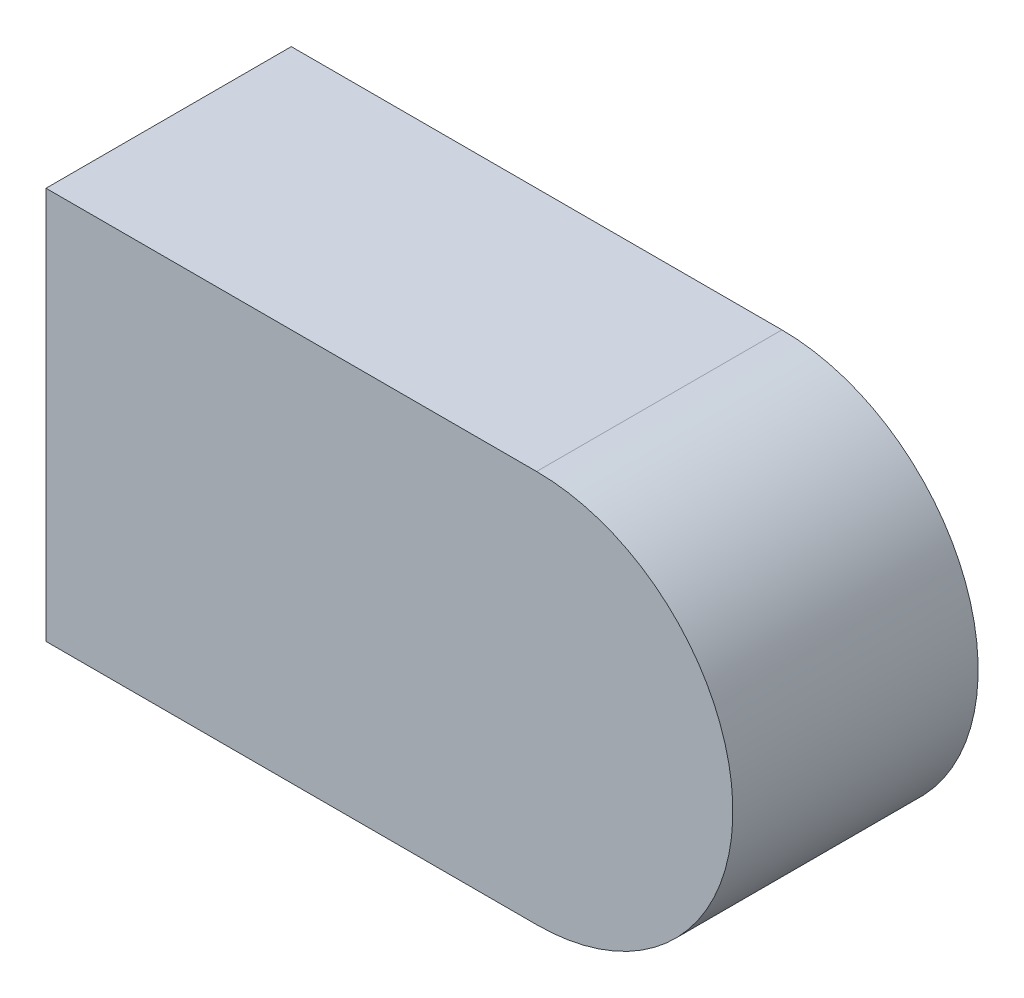
ISO-10303-21;
HEADER;
FILE_DESCRIPTION(('STEP AP214'),'2;1');
FILE_NAME('part.step','',(''),(''),'','','');
FILE_SCHEMA(('AUTOMOTIVE_DESIGN { 1 0 10303 214 1 1 1 1 }'));
ENDSEC;
DATA;
#1=APPLICATION_CONTEXT('core data for automotive mechanical design processes');
#2=APPLICATION_PROTOCOL_DEFINITION('international standard','automotive_design',2000,#1);
#3=PRODUCT_CONTEXT('',#1,'mechanical');
#4=PRODUCT('Part','Part','',(#3));
#5=PRODUCT_RELATED_PRODUCT_CATEGORY('part','',(#4));
#6=PRODUCT_DEFINITION_FORMATION('','',#4);
#7=PRODUCT_DEFINITION_CONTEXT('part definition',#1,'design');
#8=PRODUCT_DEFINITION('design','',#6,#7);
#9=PRODUCT_DEFINITION_SHAPE('','',#8);
#10=(LENGTH_UNIT() NAMED_UNIT(*) SI_UNIT(.MILLI.,.METRE.));
#11=(NAMED_UNIT(*) PLANE_ANGLE_UNIT() SI_UNIT($,.RADIAN.));
#12=(NAMED_UNIT(*) SI_UNIT($,.STERADIAN.) SOLID_ANGLE_UNIT());
#13=UNCERTAINTY_MEASURE_WITH_UNIT(LENGTH_MEASURE(1.E-05),#10,'distance_accuracy_value','');
#14=(GEOMETRIC_REPRESENTATION_CONTEXT(3) GLOBAL_UNCERTAINTY_ASSIGNED_CONTEXT((#13)) GLOBAL_UNIT_ASSIGNED_CONTEXT((#10,
#11,#12)) REPRESENTATION_CONTEXT('',''));
#15=CARTESIAN_POINT('',(0.,0.,0.));
#16=DIRECTION('',(0.,0.,1.));
#17=DIRECTION('',(1.,0.,0.));
#18=AXIS2_PLACEMENT_3D('',#15,#16,#17);
#19=CARTESIAN_POINT('',(-200.,212.5,-25.));
#20=DIRECTION('',(0.,0.,1.));
#21=DIRECTION('',(1.,0.,0.));
#22=AXIS2_PLACEMENT_3D('',#19,#20,#21);
#23=CYLINDRICAL_SURFACE('',#22,20.);
#24=CARTESIAN_POINT('',(-200.,212.5,0.));
#25=DIRECTION('',(0.,0.,1.));
#26=DIRECTION('',(1.,0.,0.));
#27=AXIS2_PLACEMENT_3D('',#24,#25,#26);
#28=CIRCLE('',#27,20.);
#29=CARTESIAN_POINT('',(-200.,192.5,0.));
#30=VERTEX_POINT('',#29);
#31=CARTESIAN_POINT('',(-200.,232.5,0.));
#32=VERTEX_POINT('',#31);
#33=EDGE_CURVE('E101',#30,#32,#28,.T.);
#34=ORIENTED_EDGE('',*,*,#33,.F.);
#35=DIRECTION('',(0.,0.,1.));
#36=VECTOR('',#35,1.);
#37=CARTESIAN_POINT('',(-200.,192.5,-25.));
#38=LINE('',#37,#36);
#39=CARTESIAN_POINT('',(-200.,192.5,-25.));
#40=VERTEX_POINT('',#39);
#41=EDGE_CURVE('E11',#40,#30,#38,.T.);
#42=ORIENTED_EDGE('',*,*,#41,.F.);
#43=CARTESIAN_POINT('',(-200.,212.5,-25.));
#44=DIRECTION('',(0.,0.,1.));
#45=DIRECTION('',(1.,0.,0.));
#46=AXIS2_PLACEMENT_3D('',#43,#44,#45);
#47=CIRCLE('',#46,20.);
#48=CARTESIAN_POINT('',(-200.,232.5,-25.));
#49=VERTEX_POINT('',#48);
#50=EDGE_CURVE('E95',#40,#49,#47,.T.);
#51=ORIENTED_EDGE('',*,*,#50,.T.);
#52=DIRECTION('',(0.,0.,1.));
#53=VECTOR('',#52,1.);
#54=CARTESIAN_POINT('',(-200.,232.5,-25.));
#55=LINE('',#54,#53);
#56=EDGE_CURVE('E40',#49,#32,#55,.T.);
#57=ORIENTED_EDGE('',*,*,#56,.T.);
#58=EDGE_LOOP('',(#34,#42,#51,#57));
#59=FACE_BOUND('',#58,.T.);
#60=ADVANCED_FACE('F37',(#59),#23,.T.);
#61=CARTESIAN_POINT('',(-250.,192.5,-25.));
#62=DIRECTION('',(0.,-1.,0.));
#63=DIRECTION('',(0.,0.,-1.));
#64=AXIS2_PLACEMENT_3D('',#61,#62,#63);
#65=PLANE('',#64);
#66=DIRECTION('',(1.,0.,0.));
#67=VECTOR('',#66,1.);
#68=CARTESIAN_POINT('',(-250.,192.5,0.));
#69=LINE('',#68,#67);
#70=CARTESIAN_POINT('',(-250.,192.5,0.));
#71=VERTEX_POINT('',#70);
#72=EDGE_CURVE('E97',#71,#30,#69,.T.);
#73=ORIENTED_EDGE('',*,*,#72,.F.);
#74=DIRECTION('',(0.,0.,1.));
#75=VECTOR('',#74,1.);
#76=CARTESIAN_POINT('',(-250.,192.5,-25.));
#77=LINE('',#76,#75);
#78=CARTESIAN_POINT('',(-250.,192.5,-25.));
#79=VERTEX_POINT('',#78);
#80=EDGE_CURVE('E46',#79,#71,#77,.T.);
#81=ORIENTED_EDGE('',*,*,#80,.F.);
#82=DIRECTION('',(1.,0.,0.));
#83=VECTOR('',#82,1.);
#84=CARTESIAN_POINT('',(-250.,192.5,-25.));
#85=LINE('',#84,#83);
#86=EDGE_CURVE('E92',#79,#40,#85,.T.);
#87=ORIENTED_EDGE('',*,*,#86,.T.);
#88=ORIENTED_EDGE('',*,*,#41,.T.);
#89=EDGE_LOOP('',(#73,#81,#87,#88));
#90=FACE_BOUND('',#89,.T.);
#91=ADVANCED_FACE('F111',(#90),#65,.T.);
#92=CARTESIAN_POINT('',(-250.,232.5,-25.));
#93=DIRECTION('',(-1.,0.,0.));
#94=DIRECTION('',(0.,0.,1.));
#95=AXIS2_PLACEMENT_3D('',#92,#93,#94);
#96=PLANE('',#95);
#97=DIRECTION('',(0.,-1.,0.));
#98=VECTOR('',#97,1.);
#99=CARTESIAN_POINT('',(-250.,232.5,0.));
#100=LINE('',#99,#98);
#101=CARTESIAN_POINT('',(-250.,232.5,0.));
#102=VERTEX_POINT('',#101);
#103=EDGE_CURVE('E87',#102,#71,#100,.T.);
#104=ORIENTED_EDGE('',*,*,#103,.F.);
#105=DIRECTION('',(0.,0.,1.));
#106=VECTOR('',#105,1.);
#107=CARTESIAN_POINT('',(-250.,232.5,-25.));
#108=LINE('',#107,#106);
#109=CARTESIAN_POINT('',(-250.,232.5,-25.));
#110=VERTEX_POINT('',#109);
#111=EDGE_CURVE('E82',#110,#102,#108,.T.);
#112=ORIENTED_EDGE('',*,*,#111,.F.);
#113=DIRECTION('',(0.,-1.,0.));
#114=VECTOR('',#113,1.);
#115=CARTESIAN_POINT('',(-250.,232.5,-25.));
#116=LINE('',#115,#114);
#117=EDGE_CURVE('E85',#110,#79,#116,.T.);
#118=ORIENTED_EDGE('',*,*,#117,.T.);
#119=ORIENTED_EDGE('',*,*,#80,.T.);
#120=EDGE_LOOP('',(#104,#112,#118,#119));
#121=FACE_BOUND('',#120,.T.);
#122=ADVANCED_FACE('F84',(#121),#96,.T.);
#123=CARTESIAN_POINT('',(-200.,232.5,-25.));
#124=DIRECTION('',(0.,1.,0.));
#125=DIRECTION('',(0.,0.,1.));
#126=AXIS2_PLACEMENT_3D('',#123,#124,#125);
#127=PLANE('',#126);
#128=DIRECTION('',(-1.,0.,0.));
#129=VECTOR('',#128,1.);
#130=CARTESIAN_POINT('',(-200.,232.5,0.));
#131=LINE('',#130,#129);
#132=EDGE_CURVE('E104',#32,#102,#131,.T.);
#133=ORIENTED_EDGE('',*,*,#132,.F.);
#134=ORIENTED_EDGE('',*,*,#56,.F.);
#135=DIRECTION('',(-1.,0.,0.));
#136=VECTOR('',#135,1.);
#137=CARTESIAN_POINT('',(-200.,232.5,-25.));
#138=LINE('',#137,#136);
#139=EDGE_CURVE('E91',#49,#110,#138,.T.);
#140=ORIENTED_EDGE('',*,*,#139,.T.);
#141=ORIENTED_EDGE('',*,*,#111,.T.);
#142=EDGE_LOOP('',(#133,#134,#140,#141));
#143=FACE_BOUND('',#142,.T.);
#144=ADVANCED_FACE('F94',(#143),#127,.T.);
#145=CARTESIAN_POINT('',(-200.,212.5,-25.));
#146=DIRECTION('',(0.,0.,1.));
#147=DIRECTION('',(1.,0.,0.));
#148=AXIS2_PLACEMENT_3D('',#145,#146,#147);
#149=PLANE('',#148);
#150=ORIENTED_EDGE('',*,*,#50,.F.);
#151=ORIENTED_EDGE('',*,*,#86,.F.);
#152=ORIENTED_EDGE('',*,*,#117,.F.);
#153=ORIENTED_EDGE('',*,*,#139,.F.);
#154=EDGE_LOOP('',(#150,#151,#152,#153));
#155=FACE_BOUND('',#154,.T.);
#156=ADVANCED_FACE('F90',(#155),#149,.F.);
#157=CARTESIAN_POINT('',(-200.,212.5,0.));
#158=DIRECTION('',(0.,0.,1.));
#159=DIRECTION('',(1.,0.,0.));
#160=AXIS2_PLACEMENT_3D('',#157,#158,#159);
#161=PLANE('',#160);
#162=ORIENTED_EDGE('',*,*,#33,.T.);
#163=ORIENTED_EDGE('',*,*,#132,.T.);
#164=ORIENTED_EDGE('',*,*,#103,.T.);
#165=ORIENTED_EDGE('',*,*,#72,.T.);
#166=EDGE_LOOP('',(#162,#163,#164,#165));
#167=FACE_BOUND('',#166,.T.);
#168=ADVANCED_FACE('F110',(#167),#161,.T.);
#169=CLOSED_SHELL('',(#60,#91,#122,#144,#156,#168));
#170=MANIFOLD_SOLID_BREP('B2',#169);
#171=ADVANCED_BREP_SHAPE_REPRESENTATION('',(#18,#170),#14);
#172=SHAPE_DEFINITION_REPRESENTATION(#9,#171);
ENDSEC;
END-ISO-10303-21;
